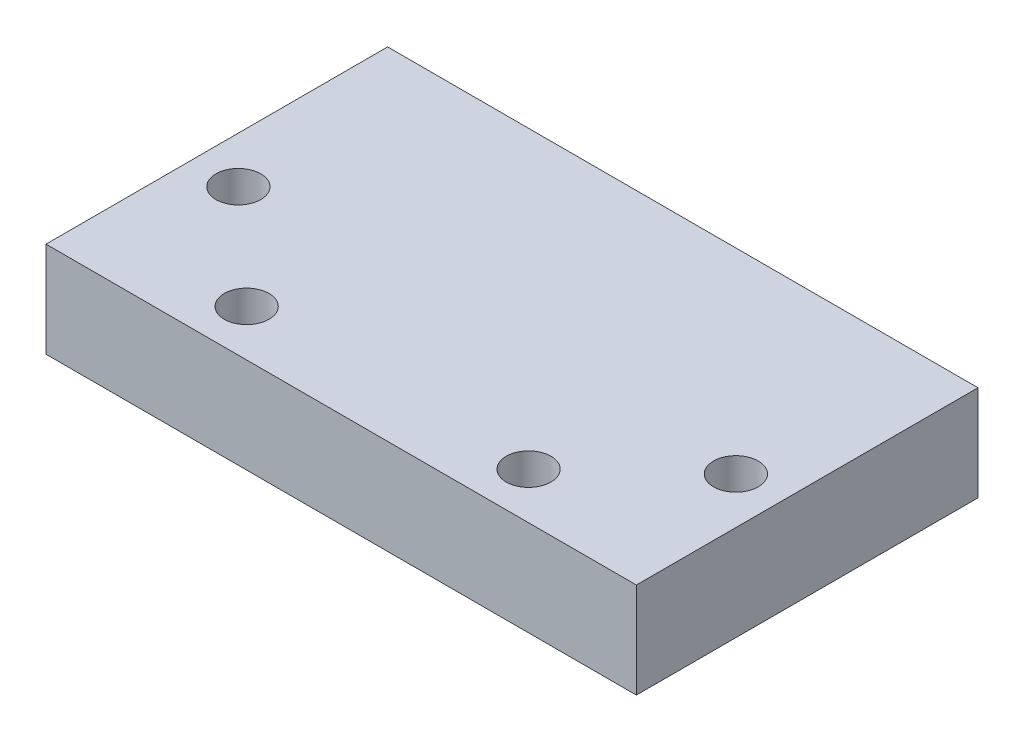
ISO-10303-21;
HEADER;
FILE_DESCRIPTION(('STEP AP214'),'2;1');
FILE_NAME('part.step','',(''),(''),'','','');
FILE_SCHEMA(('AUTOMOTIVE_DESIGN { 1 0 10303 214 1 1 1 1 }'));
ENDSEC;
DATA;
#1=APPLICATION_CONTEXT('core data for automotive mechanical design processes');
#2=APPLICATION_PROTOCOL_DEFINITION('international standard','automotive_design',2000,#1);
#3=PRODUCT_CONTEXT('',#1,'mechanical');
#4=PRODUCT('Part','Part','',(#3));
#5=PRODUCT_RELATED_PRODUCT_CATEGORY('part','',(#4));
#6=PRODUCT_DEFINITION_FORMATION('','',#4);
#7=PRODUCT_DEFINITION_CONTEXT('part definition',#1,'design');
#8=PRODUCT_DEFINITION('design','',#6,#7);
#9=PRODUCT_DEFINITION_SHAPE('','',#8);
#10=(LENGTH_UNIT() NAMED_UNIT(*) SI_UNIT(.MILLI.,.METRE.));
#11=(NAMED_UNIT(*) PLANE_ANGLE_UNIT() SI_UNIT($,.RADIAN.));
#12=(NAMED_UNIT(*) SI_UNIT($,.STERADIAN.) SOLID_ANGLE_UNIT());
#13=UNCERTAINTY_MEASURE_WITH_UNIT(LENGTH_MEASURE(1.E-05),#10,'distance_accuracy_value','');
#14=(GEOMETRIC_REPRESENTATION_CONTEXT(3) GLOBAL_UNCERTAINTY_ASSIGNED_CONTEXT((#13)) GLOBAL_UNIT_ASSIGNED_CONTEXT((#10,
#11,#12)) REPRESENTATION_CONTEXT('',''));
#15=CARTESIAN_POINT('',(0.,0.,0.));
#16=DIRECTION('',(0.,0.,1.));
#17=DIRECTION('',(1.,0.,0.));
#18=AXIS2_PLACEMENT_3D('',#15,#16,#17);
#19=CARTESIAN_POINT('',(-17.8,0.,7.5));
#20=DIRECTION('',(1.,0.,0.));
#21=DIRECTION('',(0.,0.,-1.));
#22=AXIS2_PLACEMENT_3D('',#19,#20,#21);
#23=PLANE('',#22);
#24=DIRECTION('',(0.,-1.,0.));
#25=VECTOR('',#24,1.);
#26=CARTESIAN_POINT('',(-17.8,0.,-7.5));
#27=LINE('',#26,#25);
#28=CARTESIAN_POINT('',(-17.8,5.75,-7.5));
#29=VERTEX_POINT('',#28);
#30=CARTESIAN_POINT('',(-17.8,0.,-7.5));
#31=VERTEX_POINT('',#30);
#32=EDGE_CURVE('E134',#29,#31,#27,.T.);
#33=ORIENTED_EDGE('',*,*,#32,.T.);
#34=DIRECTION('',(0.,0.,-1.));
#35=VECTOR('',#34,1.);
#36=CARTESIAN_POINT('',(-17.8,0.,7.5));
#37=LINE('',#36,#35);
#38=CARTESIAN_POINT('',(-17.8,0.,13.1));
#39=VERTEX_POINT('',#38);
#40=EDGE_CURVE('E11',#39,#31,#37,.T.);
#41=ORIENTED_EDGE('',*,*,#40,.F.);
#42=DIRECTION('',(0.,-1.,0.));
#43=VECTOR('',#42,1.);
#44=CARTESIAN_POINT('',(-17.8,0.,13.1));
#45=LINE('',#44,#43);
#46=CARTESIAN_POINT('',(-17.8,5.75,13.1));
#47=VERTEX_POINT('',#46);
#48=EDGE_CURVE('E119',#47,#39,#45,.T.);
#49=ORIENTED_EDGE('',*,*,#48,.F.);
#50=DIRECTION('',(0.,0.,-1.));
#51=VECTOR('',#50,1.);
#52=CARTESIAN_POINT('',(-17.8,5.75,7.5));
#53=LINE('',#52,#51);
#54=EDGE_CURVE('E111',#47,#29,#53,.T.);
#55=ORIENTED_EDGE('',*,*,#54,.T.);
#56=EDGE_LOOP('',(#33,#41,#49,#55));
#57=FACE_BOUND('',#56,.T.);
#58=ADVANCED_FACE('F31',(#57),#23,.F.);
#59=CARTESIAN_POINT('',(-12.2,2.75,7.5));
#60=DIRECTION('',(-1.,0.,0.));
#61=DIRECTION('',(0.,0.,1.));
#62=AXIS2_PLACEMENT_3D('',#59,#60,#61);
#63=PLANE('',#62);
#64=DIRECTION('',(0.,1.,0.));
#65=VECTOR('',#64,1.);
#66=CARTESIAN_POINT('',(-12.2,2.75,-7.5));
#67=LINE('',#66,#65);
#68=CARTESIAN_POINT('',(-12.2,0.,-7.5));
#69=VERTEX_POINT('',#68);
#70=CARTESIAN_POINT('',(-12.2,2.75,-7.5));
#71=VERTEX_POINT('',#70);
#72=EDGE_CURVE('E181',#69,#71,#67,.T.);
#73=ORIENTED_EDGE('',*,*,#72,.T.);
#74=DIRECTION('',(0.,0.,-1.));
#75=VECTOR('',#74,1.);
#76=CARTESIAN_POINT('',(-12.2,2.75,7.5));
#77=LINE('',#76,#75);
#78=CARTESIAN_POINT('',(-12.2,2.75,7.5));
#79=VERTEX_POINT('',#78);
#80=EDGE_CURVE('E152',#79,#71,#77,.T.);
#81=ORIENTED_EDGE('',*,*,#80,.F.);
#82=DIRECTION('',(0.,1.,0.));
#83=VECTOR('',#82,1.);
#84=CARTESIAN_POINT('',(-12.2,2.75,7.5));
#85=LINE('',#84,#83);
#86=CARTESIAN_POINT('',(-12.2,0.,7.5));
#87=VERTEX_POINT('',#86);
#88=EDGE_CURVE('E141',#87,#79,#85,.T.);
#89=ORIENTED_EDGE('',*,*,#88,.F.);
#90=DIRECTION('',(0.,0.,-1.));
#91=VECTOR('',#90,1.);
#92=CARTESIAN_POINT('',(-12.2,0.,7.5));
#93=LINE('',#92,#91);
#94=EDGE_CURVE('E40',#87,#69,#93,.T.);
#95=ORIENTED_EDGE('',*,*,#94,.T.);
#96=EDGE_LOOP('',(#73,#81,#89,#95));
#97=FACE_BOUND('',#96,.T.);
#98=ADVANCED_FACE('F187',(#97),#63,.F.);
#99=CARTESIAN_POINT('',(12.2,2.75,7.5));
#100=DIRECTION('',(0.,1.,0.));
#101=DIRECTION('',(0.,0.,1.));
#102=AXIS2_PLACEMENT_3D('',#99,#100,#101);
#103=PLANE('',#102);
#104=DIRECTION('',(1.,0.,0.));
#105=VECTOR('',#104,1.);
#106=CARTESIAN_POINT('',(12.2,2.75,-7.5));
#107=LINE('',#106,#105);
#108=CARTESIAN_POINT('',(12.2,2.75,-7.5));
#109=VERTEX_POINT('',#108);
#110=EDGE_CURVE('E177',#71,#109,#107,.T.);
#111=ORIENTED_EDGE('',*,*,#110,.T.);
#112=DIRECTION('',(0.,0.,-1.));
#113=VECTOR('',#112,1.);
#114=CARTESIAN_POINT('',(12.2,2.75,7.5));
#115=LINE('',#114,#113);
#116=CARTESIAN_POINT('',(12.2,2.75,7.5));
#117=VERTEX_POINT('',#116);
#118=EDGE_CURVE('E49',#117,#109,#115,.T.);
#119=ORIENTED_EDGE('',*,*,#118,.F.);
#120=DIRECTION('',(1.,0.,0.));
#121=VECTOR('',#120,1.);
#122=CARTESIAN_POINT('',(12.2,2.75,7.5));
#123=LINE('',#122,#121);
#124=EDGE_CURVE('E137',#79,#117,#123,.T.);
#125=ORIENTED_EDGE('',*,*,#124,.F.);
#126=ORIENTED_EDGE('',*,*,#80,.T.);
#127=EDGE_LOOP('',(#111,#119,#125,#126));
#128=FACE_BOUND('',#127,.T.);
#129=ADVANCED_FACE('F188',(#128),#103,.F.);
#130=CARTESIAN_POINT('',(12.2,0.,7.5));
#131=DIRECTION('',(1.,0.,0.));
#132=DIRECTION('',(0.,0.,-1.));
#133=AXIS2_PLACEMENT_3D('',#130,#131,#132);
#134=PLANE('',#133);
#135=DIRECTION('',(0.,-1.,0.));
#136=VECTOR('',#135,1.);
#137=CARTESIAN_POINT('',(12.2,0.,-7.5));
#138=LINE('',#137,#136);
#139=CARTESIAN_POINT('',(12.2,0.,-7.5));
#140=VERTEX_POINT('',#139);
#141=EDGE_CURVE('E176',#109,#140,#138,.T.);
#142=ORIENTED_EDGE('',*,*,#141,.T.);
#143=DIRECTION('',(0.,0.,-1.));
#144=VECTOR('',#143,1.);
#145=CARTESIAN_POINT('',(12.2,0.,7.5));
#146=LINE('',#145,#144);
#147=CARTESIAN_POINT('',(12.2,0.,7.5));
#148=VERTEX_POINT('',#147);
#149=EDGE_CURVE('E164',#148,#140,#146,.T.);
#150=ORIENTED_EDGE('',*,*,#149,.F.);
#151=DIRECTION('',(0.,-1.,0.));
#152=VECTOR('',#151,1.);
#153=CARTESIAN_POINT('',(12.2,0.,7.5));
#154=LINE('',#153,#152);
#155=EDGE_CURVE('E140',#117,#148,#154,.T.);
#156=ORIENTED_EDGE('',*,*,#155,.F.);
#157=ORIENTED_EDGE('',*,*,#118,.T.);
#158=EDGE_LOOP('',(#142,#150,#156,#157));
#159=FACE_BOUND('',#158,.T.);
#160=ADVANCED_FACE('F190',(#159),#134,.F.);
#161=CARTESIAN_POINT('',(17.8,0.,7.5));
#162=DIRECTION('',(0.,1.,0.));
#163=DIRECTION('',(-1.,0.,0.));
#164=AXIS2_PLACEMENT_3D('',#161,#162,#163);
#165=PLANE('',#164);
#166=CARTESIAN_POINT('',(15.,0.,4.3));
#167=DIRECTION('',(0.,1.,0.));
#168=DIRECTION('',(-1.,0.,0.));
#169=AXIS2_PLACEMENT_3D('',#166,#167,#168);
#170=CIRCLE('',#169,1.35);
#171=CARTESIAN_POINT('',(13.65,0.,4.3));
#172=VERTEX_POINT('',#171);
#173=EDGE_CURVE('E332',#172,#172,#170,.T.);
#174=ORIENTED_EDGE('',*,*,#173,.T.);
#175=EDGE_LOOP('',(#174));
#176=FACE_BOUND('',#175,.T.);
#177=CARTESIAN_POINT('',(8.5,0.,10.3));
#178=DIRECTION('',(0.,1.,0.));
#179=DIRECTION('',(-1.,0.,0.));
#180=AXIS2_PLACEMENT_3D('',#177,#178,#179);
#181=CIRCLE('',#180,1.35);
#182=CARTESIAN_POINT('',(7.15,0.,10.3));
#183=VERTEX_POINT('',#182);
#184=EDGE_CURVE('E336',#183,#183,#181,.T.);
#185=ORIENTED_EDGE('',*,*,#184,.T.);
#186=EDGE_LOOP('',(#185));
#187=FACE_BOUND('',#186,.T.);
#188=CARTESIAN_POINT('',(-15.,0.,4.3));
#189=DIRECTION('',(0.,1.,0.));
#190=DIRECTION('',(-1.,0.,0.));
#191=AXIS2_PLACEMENT_3D('',#188,#189,#190);
#192=CIRCLE('',#191,1.35);
#193=CARTESIAN_POINT('',(-16.35,0.,4.3));
#194=VERTEX_POINT('',#193);
#195=EDGE_CURVE('E345',#194,#194,#192,.T.);
#196=ORIENTED_EDGE('',*,*,#195,.T.);
#197=EDGE_LOOP('',(#196));
#198=FACE_BOUND('',#197,.T.);
#199=CARTESIAN_POINT('',(-8.5,0.,10.3));
#200=DIRECTION('',(0.,1.,0.));
#201=DIRECTION('',(-1.,0.,0.));
#202=AXIS2_PLACEMENT_3D('',#199,#200,#201);
#203=CIRCLE('',#202,1.35);
#204=CARTESIAN_POINT('',(-9.85,0.,10.3));
#205=VERTEX_POINT('',#204);
#206=EDGE_CURVE('E127',#205,#205,#203,.T.);
#207=ORIENTED_EDGE('',*,*,#206,.T.);
#208=EDGE_LOOP('',(#207));
#209=FACE_BOUND('',#208,.T.);
#210=DIRECTION('',(1.,0.,0.));
#211=VECTOR('',#210,1.);
#212=CARTESIAN_POINT('',(17.8,0.,-7.5));
#213=LINE('',#212,#211);
#214=CARTESIAN_POINT('',(17.8,0.,-7.5));
#215=VERTEX_POINT('',#214);
#216=EDGE_CURVE('E158',#140,#215,#213,.T.);
#217=ORIENTED_EDGE('',*,*,#216,.T.);
#218=DIRECTION('',(0.,0.,-1.));
#219=VECTOR('',#218,1.);
#220=CARTESIAN_POINT('',(17.8,0.,7.5));
#221=LINE('',#220,#219);
#222=CARTESIAN_POINT('',(17.8,0.,13.1));
#223=VERTEX_POINT('',#222);
#224=EDGE_CURVE('E110',#223,#215,#221,.T.);
#225=ORIENTED_EDGE('',*,*,#224,.F.);
#226=DIRECTION('',(1.,0.,0.));
#227=VECTOR('',#226,1.);
#228=CARTESIAN_POINT('',(-17.8,0.,13.1));
#229=LINE('',#228,#227);
#230=EDGE_CURVE('E124',#39,#223,#229,.T.);
#231=ORIENTED_EDGE('',*,*,#230,.F.);
#232=ORIENTED_EDGE('',*,*,#40,.T.);
#233=DIRECTION('',(1.,0.,0.));
#234=VECTOR('',#233,1.);
#235=CARTESIAN_POINT('',(-12.2,0.,-7.5));
#236=LINE('',#235,#234);
#237=EDGE_CURVE('E182',#31,#69,#236,.T.);
#238=ORIENTED_EDGE('',*,*,#237,.T.);
#239=ORIENTED_EDGE('',*,*,#94,.F.);
#240=DIRECTION('',(1.,0.,0.));
#241=VECTOR('',#240,1.);
#242=CARTESIAN_POINT('',(-17.8,0.,7.5));
#243=LINE('',#242,#241);
#244=EDGE_CURVE('E125',#87,#148,#243,.T.);
#245=ORIENTED_EDGE('',*,*,#244,.T.);
#246=ORIENTED_EDGE('',*,*,#149,.T.);
#247=EDGE_LOOP('',(#217,#225,#231,#232,#238,#239,#245,#246));
#248=FACE_BOUND('',#247,.T.);
#249=ADVANCED_FACE('F169',(#176,#187,#198,#209,#248),#165,.F.);
#250=CARTESIAN_POINT('',(17.8,5.75,7.5));
#251=DIRECTION('',(-1.,0.,0.));
#252=DIRECTION('',(0.,0.,1.));
#253=AXIS2_PLACEMENT_3D('',#250,#251,#252);
#254=PLANE('',#253);
#255=DIRECTION('',(0.,1.,0.));
#256=VECTOR('',#255,1.);
#257=CARTESIAN_POINT('',(17.8,5.75,-7.5));
#258=LINE('',#257,#256);
#259=CARTESIAN_POINT('',(17.8,5.75,-7.5));
#260=VERTEX_POINT('',#259);
#261=EDGE_CURVE('E79',#215,#260,#258,.T.);
#262=ORIENTED_EDGE('',*,*,#261,.T.);
#263=DIRECTION('',(0.,0.,-1.));
#264=VECTOR('',#263,1.);
#265=CARTESIAN_POINT('',(17.8,5.75,7.5));
#266=LINE('',#265,#264);
#267=CARTESIAN_POINT('',(17.8,5.75,13.1));
#268=VERTEX_POINT('',#267);
#269=EDGE_CURVE('E105',#268,#260,#266,.T.);
#270=ORIENTED_EDGE('',*,*,#269,.F.);
#271=DIRECTION('',(0.,1.,0.));
#272=VECTOR('',#271,1.);
#273=CARTESIAN_POINT('',(17.8,0.,13.1));
#274=LINE('',#273,#272);
#275=EDGE_CURVE('E109',#223,#268,#274,.T.);
#276=ORIENTED_EDGE('',*,*,#275,.F.);
#277=ORIENTED_EDGE('',*,*,#224,.T.);
#278=EDGE_LOOP('',(#262,#270,#276,#277));
#279=FACE_BOUND('',#278,.T.);
#280=ADVANCED_FACE('F107',(#279),#254,.F.);
#281=CARTESIAN_POINT('',(-17.8,5.75,7.5));
#282=DIRECTION('',(0.,-1.,0.));
#283=DIRECTION('',(0.,0.,-1.));
#284=AXIS2_PLACEMENT_3D('',#281,#282,#283);
#285=PLANE('',#284);
#286=CARTESIAN_POINT('',(15.,5.75,4.3));
#287=DIRECTION('',(0.,1.,0.));
#288=DIRECTION('',(0.,0.,1.));
#289=AXIS2_PLACEMENT_3D('',#286,#287,#288);
#290=CIRCLE('',#289,1.35);
#291=CARTESIAN_POINT('',(15.,5.75,5.65));
#292=VERTEX_POINT('',#291);
#293=EDGE_CURVE('E329',#292,#292,#290,.T.);
#294=ORIENTED_EDGE('',*,*,#293,.F.);
#295=EDGE_LOOP('',(#294));
#296=FACE_BOUND('',#295,.T.);
#297=CARTESIAN_POINT('',(8.5,5.75,10.3));
#298=DIRECTION('',(0.,1.,0.));
#299=DIRECTION('',(0.,0.,1.));
#300=AXIS2_PLACEMENT_3D('',#297,#298,#299);
#301=CIRCLE('',#300,1.35);
#302=CARTESIAN_POINT('',(8.5,5.75,11.65));
#303=VERTEX_POINT('',#302);
#304=EDGE_CURVE('E333',#303,#303,#301,.T.);
#305=ORIENTED_EDGE('',*,*,#304,.F.);
#306=EDGE_LOOP('',(#305));
#307=FACE_BOUND('',#306,.T.);
#308=CARTESIAN_POINT('',(-15.,5.75,4.3));
#309=DIRECTION('',(0.,1.,0.));
#310=DIRECTION('',(0.,0.,1.));
#311=AXIS2_PLACEMENT_3D('',#308,#309,#310);
#312=CIRCLE('',#311,1.35);
#313=CARTESIAN_POINT('',(-15.,5.75,5.65));
#314=VERTEX_POINT('',#313);
#315=EDGE_CURVE('E342',#314,#314,#312,.T.);
#316=ORIENTED_EDGE('',*,*,#315,.F.);
#317=EDGE_LOOP('',(#316));
#318=FACE_BOUND('',#317,.T.);
#319=CARTESIAN_POINT('',(-8.5,5.75,10.3));
#320=DIRECTION('',(0.,1.,0.));
#321=DIRECTION('',(0.,0.,1.));
#322=AXIS2_PLACEMENT_3D('',#319,#320,#321);
#323=CIRCLE('',#322,1.35);
#324=CARTESIAN_POINT('',(-8.5,5.75,11.65));
#325=VERTEX_POINT('',#324);
#326=EDGE_CURVE('E347',#325,#325,#323,.T.);
#327=ORIENTED_EDGE('',*,*,#326,.F.);
#328=EDGE_LOOP('',(#327));
#329=FACE_BOUND('',#328,.T.);
#330=DIRECTION('',(-1.,0.,0.));
#331=VECTOR('',#330,1.);
#332=CARTESIAN_POINT('',(-17.8,5.75,-7.5));
#333=LINE('',#332,#331);
#334=EDGE_CURVE('E85',#260,#29,#333,.T.);
#335=ORIENTED_EDGE('',*,*,#334,.T.);
#336=ORIENTED_EDGE('',*,*,#54,.F.);
#337=DIRECTION('',(-1.,0.,0.));
#338=VECTOR('',#337,1.);
#339=CARTESIAN_POINT('',(-17.8,5.75,13.1));
#340=LINE('',#339,#338);
#341=EDGE_CURVE('E114',#268,#47,#340,.T.);
#342=ORIENTED_EDGE('',*,*,#341,.F.);
#343=ORIENTED_EDGE('',*,*,#269,.T.);
#344=EDGE_LOOP('',(#335,#336,#342,#343));
#345=FACE_BOUND('',#344,.T.);
#346=ADVANCED_FACE('F115',(#296,#307,#318,#329,#345),#285,.F.);
#347=CARTESIAN_POINT('',(-17.8,5.75,-7.5));
#348=DIRECTION('',(0.,0.,-1.));
#349=DIRECTION('',(-1.,0.,0.));
#350=AXIS2_PLACEMENT_3D('',#347,#348,#349);
#351=PLANE('',#350);
#352=ORIENTED_EDGE('',*,*,#32,.F.);
#353=ORIENTED_EDGE('',*,*,#334,.F.);
#354=ORIENTED_EDGE('',*,*,#261,.F.);
#355=ORIENTED_EDGE('',*,*,#216,.F.);
#356=ORIENTED_EDGE('',*,*,#141,.F.);
#357=ORIENTED_EDGE('',*,*,#110,.F.);
#358=ORIENTED_EDGE('',*,*,#72,.F.);
#359=ORIENTED_EDGE('',*,*,#237,.F.);
#360=EDGE_LOOP('',(#352,#353,#354,#355,#356,#357,#358,#359));
#361=FACE_BOUND('',#360,.T.);
#362=ADVANCED_FACE('F174',(#361),#351,.T.);
#363=CARTESIAN_POINT('',(17.8,5.75,13.1));
#364=DIRECTION('',(0.,0.,-1.));
#365=DIRECTION('',(-1.,0.,0.));
#366=AXIS2_PLACEMENT_3D('',#363,#364,#365);
#367=PLANE('',#366);
#368=ORIENTED_EDGE('',*,*,#275,.T.);
#369=ORIENTED_EDGE('',*,*,#341,.T.);
#370=ORIENTED_EDGE('',*,*,#48,.T.);
#371=ORIENTED_EDGE('',*,*,#230,.T.);
#372=EDGE_LOOP('',(#368,#369,#370,#371));
#373=FACE_BOUND('',#372,.T.);
#374=ADVANCED_FACE('F122',(#373),#367,.F.);
#375=CARTESIAN_POINT('',(17.8,5.75,7.5));
#376=DIRECTION('',(0.,0.,-1.));
#377=DIRECTION('',(-1.,0.,0.));
#378=AXIS2_PLACEMENT_3D('',#375,#376,#377);
#379=PLANE('',#378);
#380=ORIENTED_EDGE('',*,*,#244,.F.);
#381=ORIENTED_EDGE('',*,*,#88,.T.);
#382=ORIENTED_EDGE('',*,*,#124,.T.);
#383=ORIENTED_EDGE('',*,*,#155,.T.);
#384=EDGE_LOOP('',(#380,#381,#382,#383));
#385=FACE_BOUND('',#384,.T.);
#386=ADVANCED_FACE('F189',(#385),#379,.T.);
#387=CARTESIAN_POINT('',(-8.5,-5.00000000005704E-05,10.3));
#388=DIRECTION('',(0.,1.,0.));
#389=DIRECTION('',(0.,0.,1.));
#390=AXIS2_PLACEMENT_3D('',#387,#388,#389);
#391=CYLINDRICAL_SURFACE('',#390,1.35);
#392=ORIENTED_EDGE('',*,*,#326,.T.);
#393=EDGE_LOOP('',(#392));
#394=FACE_BOUND('',#393,.T.);
#395=ORIENTED_EDGE('',*,*,#206,.F.);
#396=EDGE_LOOP('',(#395));
#397=FACE_BOUND('',#396,.T.);
#398=ADVANCED_FACE('F245',(#394,#397),#391,.F.);
#399=CARTESIAN_POINT('',(-15.,-5.00000000005704E-05,4.3));
#400=DIRECTION('',(0.,1.,0.));
#401=DIRECTION('',(0.,0.,1.));
#402=AXIS2_PLACEMENT_3D('',#399,#400,#401);
#403=CYLINDRICAL_SURFACE('',#402,1.35);
#404=ORIENTED_EDGE('',*,*,#315,.T.);
#405=EDGE_LOOP('',(#404));
#406=FACE_BOUND('',#405,.T.);
#407=ORIENTED_EDGE('',*,*,#195,.F.);
#408=EDGE_LOOP('',(#407));
#409=FACE_BOUND('',#408,.T.);
#410=ADVANCED_FACE('F269',(#406,#409),#403,.F.);
#411=CARTESIAN_POINT('',(8.5,-5.00000000005704E-05,10.3));
#412=DIRECTION('',(0.,1.,0.));
#413=DIRECTION('',(0.,0.,1.));
#414=AXIS2_PLACEMENT_3D('',#411,#412,#413);
#415=CYLINDRICAL_SURFACE('',#414,1.35);
#416=ORIENTED_EDGE('',*,*,#304,.T.);
#417=EDGE_LOOP('',(#416));
#418=FACE_BOUND('',#417,.T.);
#419=ORIENTED_EDGE('',*,*,#184,.F.);
#420=EDGE_LOOP('',(#419));
#421=FACE_BOUND('',#420,.T.);
#422=ADVANCED_FACE('F279',(#418,#421),#415,.F.);
#423=CARTESIAN_POINT('',(15.,-5.00000000005704E-05,4.3));
#424=DIRECTION('',(0.,1.,0.));
#425=DIRECTION('',(0.,0.,1.));
#426=AXIS2_PLACEMENT_3D('',#423,#424,#425);
#427=CYLINDRICAL_SURFACE('',#426,1.35);
#428=ORIENTED_EDGE('',*,*,#293,.T.);
#429=EDGE_LOOP('',(#428));
#430=FACE_BOUND('',#429,.T.);
#431=ORIENTED_EDGE('',*,*,#173,.F.);
#432=EDGE_LOOP('',(#431));
#433=FACE_BOUND('',#432,.T.);
#434=ADVANCED_FACE('F289',(#430,#433),#427,.F.);
#435=CLOSED_SHELL('',(#58,#98,#129,#160,#249,#280,#346,#362,#374,#386,#398,#410,#422,#434));
#436=MANIFOLD_SOLID_BREP('B2',#435);
#437=ADVANCED_BREP_SHAPE_REPRESENTATION('',(#18,#436),#14);
#438=SHAPE_DEFINITION_REPRESENTATION(#9,#437);
ENDSEC;
END-ISO-10303-21;
